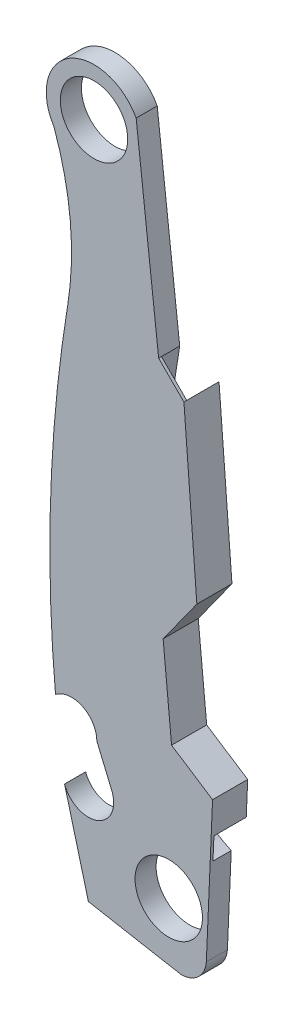
ISO-10303-21;
HEADER;
FILE_DESCRIPTION(('STEP AP214'),'2;1');
FILE_NAME('part.step','',(''),(''),'','','');
FILE_SCHEMA(('AUTOMOTIVE_DESIGN { 1 0 10303 214 1 1 1 1 }'));
ENDSEC;
DATA;
#1=APPLICATION_CONTEXT('core data for automotive mechanical design processes');
#2=APPLICATION_PROTOCOL_DEFINITION('international standard','automotive_design',2000,#1);
#3=PRODUCT_CONTEXT('',#1,'mechanical');
#4=PRODUCT('Part','Part','',(#3));
#5=PRODUCT_RELATED_PRODUCT_CATEGORY('part','',(#4));
#6=PRODUCT_DEFINITION_FORMATION('','',#4);
#7=PRODUCT_DEFINITION_CONTEXT('part definition',#1,'design');
#8=PRODUCT_DEFINITION('design','',#6,#7);
#9=PRODUCT_DEFINITION_SHAPE('','',#8);
#10=(LENGTH_UNIT() NAMED_UNIT(*) SI_UNIT(.MILLI.,.METRE.));
#11=(NAMED_UNIT(*) PLANE_ANGLE_UNIT() SI_UNIT($,.RADIAN.));
#12=(NAMED_UNIT(*) SI_UNIT($,.STERADIAN.) SOLID_ANGLE_UNIT());
#13=UNCERTAINTY_MEASURE_WITH_UNIT(LENGTH_MEASURE(1.E-05),#10,'distance_accuracy_value','');
#14=(GEOMETRIC_REPRESENTATION_CONTEXT(3) GLOBAL_UNCERTAINTY_ASSIGNED_CONTEXT((#13)) GLOBAL_UNIT_ASSIGNED_CONTEXT((#10,
#11,#12)) REPRESENTATION_CONTEXT('',''));
#15=CARTESIAN_POINT('',(0.,0.,0.));
#16=DIRECTION('',(0.,0.,1.));
#17=DIRECTION('',(1.,0.,0.));
#18=AXIS2_PLACEMENT_3D('',#15,#16,#17);
#19=CARTESIAN_POINT('',(-11.1999347164237,-31.2281622525082,0.));
#20=DIRECTION('',(0.,0.,-1.));
#21=DIRECTION('',(-1.,0.,0.));
#22=AXIS2_PLACEMENT_3D('',#19,#20,#21);
#23=PLANE('',#22);
#24=CARTESIAN_POINT('',(-19.0739347164237,29.4778377474918,0.));
#25=DIRECTION('',(0.,0.,1.));
#26=DIRECTION('',(1.,0.,0.));
#27=AXIS2_PLACEMENT_3D('',#24,#25,#26);
#28=CIRCLE('',#27,3.048);
#29=CARTESIAN_POINT('',(-16.0259347164237,29.4778377474918,0.));
#30=VERTEX_POINT('',#29);
#31=EDGE_CURVE('E335',#30,#30,#28,.T.);
#32=ORIENTED_EDGE('',*,*,#31,.T.);
#33=EDGE_LOOP('',(#32));
#34=FACE_BOUND('',#33,.T.);
#35=CARTESIAN_POINT('',(-12.3175347164237,-28.1039622525082,0.));
#36=DIRECTION('',(0.,0.,1.));
#37=DIRECTION('',(1.,0.,0.));
#38=AXIS2_PLACEMENT_3D('',#35,#36,#37);
#39=CIRCLE('',#38,3.04799999999983);
#40=CARTESIAN_POINT('',(-9.26953471642387,-28.1039622525082,0.));
#41=VERTEX_POINT('',#40);
#42=EDGE_CURVE('E331',#41,#41,#39,.T.);
#43=ORIENTED_EDGE('',*,*,#42,.T.);
#44=EDGE_LOOP('',(#43));
#45=FACE_BOUND('',#44,.T.);
#46=DIRECTION('',(-0.113546591160732,0.993532672656404,0.));
#47=VECTOR('',#46,1.);
#48=CARTESIAN_POINT('',(-13.2319347164237,13.7298377474918,0.));
#49=LINE('',#48,#47);
#50=CARTESIAN_POINT('',(-13.2319347164237,13.7298377474918,0.));
#51=VERTEX_POINT('',#50);
#52=CARTESIAN_POINT('',(-15.2639347164237,31.5098377474918,0.));
#53=VERTEX_POINT('',#52);
#54=EDGE_CURVE('E179',#51,#53,#49,.T.);
#55=ORIENTED_EDGE('',*,*,#54,.F.);
#56=CARTESIAN_POINT('',(319.000065283576,-40.8801622525082,0.));
#57=DIRECTION('',(0.,0.,1.));
#58=DIRECTION('',(1.,0.,0.));
#59=AXIS2_PLACEMENT_3D('',#56,#57,#58);
#60=CIRCLE('',#59,336.690293777531);
#61=CARTESIAN_POINT('',(-16.0259321563204,-7.44462781080484,0.));
#62=VERTEX_POINT('',#61);
#63=EDGE_CURVE('E254',#51,#62,#60,.T.);
#64=ORIENTED_EDGE('',*,*,#63,.T.);
#65=CARTESIAN_POINT('',(8.35806528357629,-7.45580149025422,0.));
#66=DIRECTION('',(0.,0.,1.));
#67=DIRECTION('',(1.,0.,0.));
#68=AXIS2_PLACEMENT_3D('',#65,#66,#67);
#69=CIRCLE('',#68,24.384);
#70=CARTESIAN_POINT('',(-11.6694612905259,-21.3654253285768,0.));
#71=VERTEX_POINT('',#70);
#72=EDGE_CURVE('E303',#62,#71,#69,.T.);
#73=ORIENTED_EDGE('',*,*,#72,.T.);
#74=CARTESIAN_POINT('',(-3.83393471642371,-13.0438014902542,0.));
#75=DIRECTION('',(0.,0.,1.));
#76=DIRECTION('',(-1.,0.,0.));
#77=AXIS2_PLACEMENT_3D('',#74,#75,#76);
#78=CIRCLE('',#77,11.43);
#79=CARTESIAN_POINT('',(-8.57425284994842,-23.4444881980143,0.));
#80=VERTEX_POINT('',#79);
#81=EDGE_CURVE('E279',#71,#80,#78,.T.);
#82=ORIENTED_EDGE('',*,*,#81,.T.);
#83=DIRECTION('',(0.0434062002984374,0.999057506741054,0.));
#84=VECTOR('',#83,1.);
#85=CARTESIAN_POINT('',(-8.35513471642371,-18.4011622525082,0.));
#86=LINE('',#85,#84);
#87=CARTESIAN_POINT('',(-8.91911187455432,-31.3819255901632,0.));
#88=VERTEX_POINT('',#87);
#89=EDGE_CURVE('E176',#88,#80,#86,.T.);
#90=ORIENTED_EDGE('',*,*,#89,.F.);
#91=CARTESIAN_POINT('',(-11.1999347164237,-31.2281622525082,0.));
#92=DIRECTION('',(0.,0.,1.));
#93=DIRECTION('',(-1.,0.,0.));
#94=AXIS2_PLACEMENT_3D('',#91,#92,#93);
#95=CIRCLE('',#94,2.286);
#96=CARTESIAN_POINT('',(-11.1999347164234,-33.5141622525081,0.));
#97=VERTEX_POINT('',#96);
#98=EDGE_CURVE('E103',#97,#88,#95,.T.);
#99=ORIENTED_EDGE('',*,*,#98,.F.);
#100=CARTESIAN_POINT('',(206.203522791087,1186.0173540388,0.));
#101=DIRECTION('',(0.,0.,1.));
#102=DIRECTION('',(1.,0.,0.));
#103=AXIS2_PLACEMENT_3D('',#100,#101,#102);
#104=CIRCLE('',#103,1238.758);
#105=CARTESIAN_POINT('',(-19.5819347164237,-31.9901622525082,0.));
#106=VERTEX_POINT('',#105);
#107=EDGE_CURVE('E97',#106,#97,#104,.T.);
#108=ORIENTED_EDGE('',*,*,#107,.F.);
#109=DIRECTION('',(0.256307297315027,-0.966595349328283,0.));
#110=VECTOR('',#109,1.);
#111=CARTESIAN_POINT('',(-21.7371961854803,-23.8621622525082,0.));
#112=LINE('',#111,#110);
#113=CARTESIAN_POINT('',(-21.7371961854803,-23.8621622525082,0.));
#114=VERTEX_POINT('',#113);
#115=EDGE_CURVE('E166',#114,#106,#112,.T.);
#116=ORIENTED_EDGE('',*,*,#115,.F.);
#117=CARTESIAN_POINT('',(-19.5819347164237,-23.1001622525082,0.));
#118=DIRECTION('',(0.,0.,-1.));
#119=DIRECTION('',(-1.,0.,0.));
#120=AXIS2_PLACEMENT_3D('',#117,#118,#119);
#121=CIRCLE('',#120,2.286);
#122=CARTESIAN_POINT('',(-17.5341212483559,-22.0841622525082,0.));
#123=VERTEX_POINT('',#122);
#124=EDGE_CURVE('E192',#123,#114,#121,.T.);
#125=ORIENTED_EDGE('',*,*,#124,.F.);
#126=DIRECTION('',(0.388684715327392,-0.92137082223764,0.));
#127=VECTOR('',#126,1.);
#128=CARTESIAN_POINT('',(-18.8199347164237,-19.0361622525082,0.));
#129=LINE('',#128,#127);
#130=CARTESIAN_POINT('',(-18.8199347164237,-19.0361622525082,0.));
#131=VERTEX_POINT('',#130);
#132=EDGE_CURVE('E190',#131,#123,#129,.T.);
#133=ORIENTED_EDGE('',*,*,#132,.F.);
#134=CARTESIAN_POINT('',(-21.1059347164237,-19.0361622525082,0.));
#135=DIRECTION('',(0.,0.,-1.));
#136=DIRECTION('',(-1.,0.,0.));
#137=AXIS2_PLACEMENT_3D('',#134,#135,#136);
#138=CIRCLE('',#137,2.28600000000001);
#139=CARTESIAN_POINT('',(-22.5553916541724,-17.2684319038372,0.));
#140=VERTEX_POINT('',#139);
#141=EDGE_CURVE('E188',#140,#131,#138,.T.);
#142=ORIENTED_EDGE('',*,*,#141,.F.);
#143=CARTESIAN_POINT('',(99.7980652835763,-6.08216225250816,0.));
#144=DIRECTION('',(0.,0.,1.));
#145=DIRECTION('',(1.,0.,0.));
#146=AXIS2_PLACEMENT_3D('',#143,#144,#145);
#147=CIRCLE('',#146,122.863749956323);
#148=CARTESIAN_POINT('',(-21.4554647145037,13.7441464390884,0.));
#149=VERTEX_POINT('',#148);
#150=EDGE_CURVE('E186',#149,#140,#147,.T.);
#151=ORIENTED_EDGE('',*,*,#150,.F.);
#152=CARTESIAN_POINT('',(-47.7759347164237,18.0478377474918,0.));
#153=DIRECTION('',(0.,0.,-1.));
#154=DIRECTION('',(1.,0.,0.));
#155=AXIS2_PLACEMENT_3D('',#152,#153,#154);
#156=CIRCLE('',#155,26.67);
#157=CARTESIAN_POINT('',(-22.7027062252491,27.137508425209,0.));
#158=VERTEX_POINT('',#157);
#159=EDGE_CURVE('E184',#158,#149,#156,.T.);
#160=ORIENTED_EDGE('',*,*,#159,.F.);
#161=CARTESIAN_POINT('',(-19.0739347164237,29.4778377474918,0.));
#162=DIRECTION('',(0.,0.,1.));
#163=DIRECTION('',(1.,0.,0.));
#164=AXIS2_PLACEMENT_3D('',#161,#162,#163);
#165=CIRCLE('',#164,4.318);
#166=EDGE_CURVE('E182',#53,#158,#165,.T.);
#167=ORIENTED_EDGE('',*,*,#166,.F.);
#168=EDGE_LOOP('',(#55,#64,#73,#82,#90,#99,#108,#116,#125,#133,#142,#151,#160,#167));
#169=FACE_BOUND('',#168,.T.);
#170=ADVANCED_FACE('F41',(#34,#45,#169),#23,.T.);
#171=CARTESIAN_POINT('',(-8.35513471642371,-18.4011622525082,1.905));
#172=DIRECTION('',(-0.999057506741054,0.0434062002984374,0.));
#173=DIRECTION('',(-0.0434062002984374,-0.999057506741054,0.));
#174=AXIS2_PLACEMENT_3D('',#171,#172,#173);
#175=PLANE('',#174);
#176=DIRECTION('',(0.,0.,-1.));
#177=VECTOR('',#176,1.);
#178=CARTESIAN_POINT('',(-8.48654666788623,-21.4258014902542,1.651));
#179=LINE('',#178,#177);
#180=CARTESIAN_POINT('',(-8.48654666788623,-21.4258014902542,1.651));
#181=VERTEX_POINT('',#180);
#182=CARTESIAN_POINT('',(-8.48654666788623,-21.4258014902542,-1.27));
#183=VERTEX_POINT('',#182);
#184=EDGE_CURVE('E300',#181,#183,#179,.T.);
#185=ORIENTED_EDGE('',*,*,#184,.T.);
#186=DIRECTION('',(-0.0434062002984379,-0.999057506741054,0.));
#187=VECTOR('',#186,1.);
#188=CARTESIAN_POINT('',(-8.35513471642371,-18.4011622525082,-1.27));
#189=LINE('',#188,#187);
#190=CARTESIAN_POINT('',(-8.35513471642371,-18.4011622525082,-1.27));
#191=VERTEX_POINT('',#190);
#192=EDGE_CURVE('E259',#191,#183,#189,.T.);
#193=ORIENTED_EDGE('',*,*,#192,.F.);
#194=DIRECTION('',(0.,0.,-1.));
#195=VECTOR('',#194,1.);
#196=CARTESIAN_POINT('',(-8.35513471642371,-18.4011622525082,1.905));
#197=LINE('',#196,#195);
#198=CARTESIAN_POINT('',(-8.35513471642371,-18.4011622525082,1.905));
#199=VERTEX_POINT('',#198);
#200=EDGE_CURVE('E11',#199,#191,#197,.T.);
#201=ORIENTED_EDGE('',*,*,#200,.F.);
#202=DIRECTION('',(0.0434062002984374,0.999057506741054,0.));
#203=VECTOR('',#202,1.);
#204=CARTESIAN_POINT('',(-8.35513471642371,-18.4011622525082,1.905));
#205=LINE('',#204,#203);
#206=CARTESIAN_POINT('',(-8.91911187455432,-31.3819255901632,1.905));
#207=VERTEX_POINT('',#206);
#208=EDGE_CURVE('E197',#207,#199,#205,.T.);
#209=ORIENTED_EDGE('',*,*,#208,.F.);
#210=DIRECTION('',(0.,0.,-1.));
#211=VECTOR('',#210,1.);
#212=CARTESIAN_POINT('',(-8.91911187455432,-31.3819255901632,1.905));
#213=LINE('',#212,#211);
#214=EDGE_CURVE('E172',#207,#88,#213,.T.);
#215=ORIENTED_EDGE('',*,*,#214,.T.);
#216=ORIENTED_EDGE('',*,*,#89,.T.);
#217=DIRECTION('',(0.,0.,-1.));
#218=VECTOR('',#217,1.);
#219=CARTESIAN_POINT('',(-8.57425284994842,-23.4444881980143,1.651));
#220=LINE('',#219,#218);
#221=CARTESIAN_POINT('',(-8.57425284994842,-23.4444881980143,1.651));
#222=VERTEX_POINT('',#221);
#223=EDGE_CURVE('E310',#222,#80,#220,.T.);
#224=ORIENTED_EDGE('',*,*,#223,.F.);
#225=DIRECTION('',(0.0434062002984384,0.999057506741054,0.));
#226=VECTOR('',#225,1.);
#227=CARTESIAN_POINT('',(-8.48654666788623,-21.4258014902542,1.651));
#228=LINE('',#227,#226);
#229=EDGE_CURVE('E297',#222,#181,#228,.T.);
#230=ORIENTED_EDGE('',*,*,#229,.T.);
#231=EDGE_LOOP('',(#185,#193,#201,#209,#215,#216,#224,#230));
#232=FACE_BOUND('',#231,.T.);
#233=ADVANCED_FACE('F43',(#232),#175,.F.);
#234=CARTESIAN_POINT('',(-11.1999347164237,-31.2281622525082,1.905));
#235=DIRECTION('',(0.,0.,-1.));
#236=DIRECTION('',(-1.,0.,0.));
#237=AXIS2_PLACEMENT_3D('',#234,#235,#236);
#238=PLANE('',#237);
#239=ORIENTED_EDGE('',*,*,#208,.T.);
#240=DIRECTION('',(-0.838181190269875,0.545391870381083,0.));
#241=VECTOR('',#240,1.);
#242=CARTESIAN_POINT('',(-12.0635347164237,-15.9881622525082,1.905));
#243=LINE('',#242,#241);
#244=CARTESIAN_POINT('',(-12.0635347164237,-15.9881622525082,1.905));
#245=VERTEX_POINT('',#244);
#246=EDGE_CURVE('E111',#199,#245,#243,.T.);
#247=ORIENTED_EDGE('',*,*,#246,.T.);
#248=DIRECTION('',(-0.0954094042242544,0.995438117406387,0.));
#249=VECTOR('',#248,1.);
#250=CARTESIAN_POINT('',(-12.8255347164237,-8.03796225250817,1.905));
#251=LINE('',#250,#249);
#252=CARTESIAN_POINT('',(-12.8255347164237,-8.03796225250817,1.905));
#253=VERTEX_POINT('',#252);
#254=EDGE_CURVE('E240',#245,#253,#251,.T.);
#255=ORIENTED_EDGE('',*,*,#254,.T.);
#256=DIRECTION('',(0.583535844379834,0.812087383428602,0.));
#257=VECTOR('',#256,1.);
#258=CARTESIAN_POINT('',(-9.77753471642371,-3.79616225250817,1.905));
#259=LINE('',#258,#257);
#260=CARTESIAN_POINT('',(-9.77753471642371,-3.79616225250817,1.905));
#261=VERTEX_POINT('',#260);
#262=EDGE_CURVE('E345',#253,#261,#259,.T.);
#263=ORIENTED_EDGE('',*,*,#262,.T.);
#264=DIRECTION('',(-0.0764423402744023,0.997074003579159,0.));
#265=VECTOR('',#264,1.);
#266=CARTESIAN_POINT('',(-10.9459347164237,11.4438377474918,1.905));
#267=LINE('',#266,#265);
#268=CARTESIAN_POINT('',(-10.9459347164237,11.4438377474918,1.905));
#269=VERTEX_POINT('',#268);
#270=EDGE_CURVE('E347',#261,#269,#267,.T.);
#271=ORIENTED_EDGE('',*,*,#270,.T.);
#272=DIRECTION('',(-0.707106781186548,0.707106781186547,0.));
#273=VECTOR('',#272,1.);
#274=CARTESIAN_POINT('',(-13.2319347164237,13.7298377474918,1.905));
#275=LINE('',#274,#273);
#276=CARTESIAN_POINT('',(-13.2319347164237,13.7298377474918,1.905));
#277=VERTEX_POINT('',#276);
#278=EDGE_CURVE('E349',#269,#277,#275,.T.);
#279=ORIENTED_EDGE('',*,*,#278,.T.);
#280=DIRECTION('',(-0.113546591160732,0.993532672656404,0.));
#281=VECTOR('',#280,1.);
#282=CARTESIAN_POINT('',(-13.2319347164237,13.7298377474918,1.905));
#283=LINE('',#282,#281);
#284=CARTESIAN_POINT('',(-15.2639347164237,31.5098377474918,1.905));
#285=VERTEX_POINT('',#284);
#286=EDGE_CURVE('E351',#277,#285,#283,.T.);
#287=ORIENTED_EDGE('',*,*,#286,.T.);
#288=CARTESIAN_POINT('',(-19.0739347164237,29.4778377474918,1.905));
#289=DIRECTION('',(0.,0.,1.));
#290=DIRECTION('',(1.,0.,0.));
#291=AXIS2_PLACEMENT_3D('',#288,#289,#290);
#292=CIRCLE('',#291,4.318);
#293=CARTESIAN_POINT('',(-22.7027062252491,27.137508425209,1.905));
#294=VERTEX_POINT('',#293);
#295=EDGE_CURVE('E353',#285,#294,#292,.T.);
#296=ORIENTED_EDGE('',*,*,#295,.T.);
#297=CARTESIAN_POINT('',(-47.7759347164237,18.0478377474918,1.905));
#298=DIRECTION('',(0.,0.,-1.));
#299=DIRECTION('',(1.,0.,0.));
#300=AXIS2_PLACEMENT_3D('',#297,#298,#299);
#301=CIRCLE('',#300,26.67);
#302=CARTESIAN_POINT('',(-21.4554647145037,13.7441464390884,1.905));
#303=VERTEX_POINT('',#302);
#304=EDGE_CURVE('E355',#294,#303,#301,.T.);
#305=ORIENTED_EDGE('',*,*,#304,.T.);
#306=CARTESIAN_POINT('',(99.7980652835763,-6.08216225250816,1.905));
#307=DIRECTION('',(0.,0.,1.));
#308=DIRECTION('',(1.,0.,0.));
#309=AXIS2_PLACEMENT_3D('',#306,#307,#308);
#310=CIRCLE('',#309,122.863749956323);
#311=CARTESIAN_POINT('',(-22.5553916541724,-17.2684319038372,1.905));
#312=VERTEX_POINT('',#311);
#313=EDGE_CURVE('E357',#303,#312,#310,.T.);
#314=ORIENTED_EDGE('',*,*,#313,.T.);
#315=CARTESIAN_POINT('',(-21.1059347164237,-19.0361622525082,1.905));
#316=DIRECTION('',(0.,0.,-1.));
#317=DIRECTION('',(-1.,0.,0.));
#318=AXIS2_PLACEMENT_3D('',#315,#316,#317);
#319=CIRCLE('',#318,2.28600000000001);
#320=CARTESIAN_POINT('',(-18.8199347164237,-19.0361622525082,1.905));
#321=VERTEX_POINT('',#320);
#322=EDGE_CURVE('E359',#312,#321,#319,.T.);
#323=ORIENTED_EDGE('',*,*,#322,.T.);
#324=DIRECTION('',(0.388684715327392,-0.92137082223764,0.));
#325=VECTOR('',#324,1.);
#326=CARTESIAN_POINT('',(-18.8199347164237,-19.0361622525082,1.905));
#327=LINE('',#326,#325);
#328=CARTESIAN_POINT('',(-17.5341212483559,-22.0841622525082,1.905));
#329=VERTEX_POINT('',#328);
#330=EDGE_CURVE('E361',#321,#329,#327,.T.);
#331=ORIENTED_EDGE('',*,*,#330,.T.);
#332=CARTESIAN_POINT('',(-19.5819347164237,-23.1001622525082,1.905));
#333=DIRECTION('',(0.,0.,-1.));
#334=DIRECTION('',(-1.,0.,0.));
#335=AXIS2_PLACEMENT_3D('',#332,#333,#334);
#336=CIRCLE('',#335,2.286);
#337=CARTESIAN_POINT('',(-21.7371961854803,-23.8621622525082,1.905));
#338=VERTEX_POINT('',#337);
#339=EDGE_CURVE('E158',#329,#338,#336,.T.);
#340=ORIENTED_EDGE('',*,*,#339,.T.);
#341=DIRECTION('',(0.256307297315027,-0.966595349328283,0.));
#342=VECTOR('',#341,1.);
#343=CARTESIAN_POINT('',(-21.7371961854803,-23.8621622525082,1.905));
#344=LINE('',#343,#342);
#345=CARTESIAN_POINT('',(-19.5819347164237,-31.9901622525082,1.905));
#346=VERTEX_POINT('',#345);
#347=EDGE_CURVE('E151',#338,#346,#344,.T.);
#348=ORIENTED_EDGE('',*,*,#347,.T.);
#349=CARTESIAN_POINT('',(206.203522791087,1186.0173540388,1.905));
#350=DIRECTION('',(0.,0.,1.));
#351=DIRECTION('',(1.,0.,0.));
#352=AXIS2_PLACEMENT_3D('',#349,#350,#351);
#353=CIRCLE('',#352,1238.758);
#354=CARTESIAN_POINT('',(-11.1999347164234,-33.5141622525081,1.905));
#355=VERTEX_POINT('',#354);
#356=EDGE_CURVE('E156',#346,#355,#353,.T.);
#357=ORIENTED_EDGE('',*,*,#356,.T.);
#358=CARTESIAN_POINT('',(-11.1999347164237,-31.2281622525082,1.905));
#359=DIRECTION('',(0.,0.,1.));
#360=DIRECTION('',(-1.,0.,0.));
#361=AXIS2_PLACEMENT_3D('',#358,#359,#360);
#362=CIRCLE('',#361,2.286);
#363=EDGE_CURVE('E58',#355,#207,#362,.T.);
#364=ORIENTED_EDGE('',*,*,#363,.T.);
#365=EDGE_LOOP('',(#239,#247,#255,#263,#271,#279,#287,#296,#305,#314,#323,#331,#340,#348,#357,#364));
#366=FACE_BOUND('',#365,.T.);
#367=CARTESIAN_POINT('',(-19.0739347164237,29.4778377474918,1.905));
#368=DIRECTION('',(0.,0.,1.));
#369=DIRECTION('',(1.,0.,0.));
#370=AXIS2_PLACEMENT_3D('',#367,#368,#369);
#371=CIRCLE('',#370,3.048);
#372=CARTESIAN_POINT('',(-16.0259347164237,29.4778377474918,1.905));
#373=VERTEX_POINT('',#372);
#374=EDGE_CURVE('E180',#373,#373,#371,.T.);
#375=ORIENTED_EDGE('',*,*,#374,.F.);
#376=EDGE_LOOP('',(#375));
#377=FACE_BOUND('',#376,.T.);
#378=CARTESIAN_POINT('',(-12.3175347164237,-28.1039622525082,1.905));
#379=DIRECTION('',(0.,0.,1.));
#380=DIRECTION('',(1.,0.,0.));
#381=AXIS2_PLACEMENT_3D('',#378,#379,#380);
#382=CIRCLE('',#381,3.04799999999983);
#383=CARTESIAN_POINT('',(-9.26953471642387,-28.1039622525082,1.905));
#384=VERTEX_POINT('',#383);
#385=EDGE_CURVE('E332',#384,#384,#382,.T.);
#386=ORIENTED_EDGE('',*,*,#385,.F.);
#387=EDGE_LOOP('',(#386));
#388=FACE_BOUND('',#387,.T.);
#389=ADVANCED_FACE('F153',(#366,#377,#388),#238,.F.);
#390=CARTESIAN_POINT('',(-12.0635347164237,-15.9881622525082,1.905));
#391=DIRECTION('',(-0.545391870381083,-0.838181190269875,0.));
#392=DIRECTION('',(0.838181190269875,-0.545391870381083,0.));
#393=AXIS2_PLACEMENT_3D('',#390,#391,#392);
#394=PLANE('',#393);
#395=ORIENTED_EDGE('',*,*,#200,.T.);
#396=DIRECTION('',(0.838181190269875,-0.545391870381083,0.));
#397=VECTOR('',#396,1.);
#398=CARTESIAN_POINT('',(-12.0635347164237,-15.9881622525082,-1.27));
#399=LINE('',#398,#397);
#400=CARTESIAN_POINT('',(-12.0635347164237,-15.9881622525082,-1.27));
#401=VERTEX_POINT('',#400);
#402=EDGE_CURVE('E250',#401,#191,#399,.T.);
#403=ORIENTED_EDGE('',*,*,#402,.F.);
#404=DIRECTION('',(0.,0.,-1.));
#405=VECTOR('',#404,1.);
#406=CARTESIAN_POINT('',(-12.0635347164237,-15.9881622525082,1.905));
#407=LINE('',#406,#405);
#408=EDGE_CURVE('E50',#245,#401,#407,.T.);
#409=ORIENTED_EDGE('',*,*,#408,.F.);
#410=ORIENTED_EDGE('',*,*,#246,.F.);
#411=EDGE_LOOP('',(#395,#403,#409,#410));
#412=FACE_BOUND('',#411,.T.);
#413=ADVANCED_FACE('F256',(#412),#394,.F.);
#414=CARTESIAN_POINT('',(-12.8255347164237,-8.03796225250817,1.905));
#415=DIRECTION('',(-0.995438117406387,-0.0954094042242544,0.));
#416=DIRECTION('',(0.0954094042242545,-0.995438117406388,0.));
#417=AXIS2_PLACEMENT_3D('',#414,#415,#416);
#418=PLANE('',#417);
#419=ORIENTED_EDGE('',*,*,#408,.T.);
#420=DIRECTION('',(0.0954094042242544,-0.995438117406387,0.));
#421=VECTOR('',#420,1.);
#422=CARTESIAN_POINT('',(-12.8255347164237,-8.03796225250817,-1.27));
#423=LINE('',#422,#421);
#424=CARTESIAN_POINT('',(-12.8255347164237,-8.03796225250817,-1.27));
#425=VERTEX_POINT('',#424);
#426=EDGE_CURVE('E239',#425,#401,#423,.T.);
#427=ORIENTED_EDGE('',*,*,#426,.F.);
#428=DIRECTION('',(0.,0.,-1.));
#429=VECTOR('',#428,1.);
#430=CARTESIAN_POINT('',(-12.8255347164237,-8.03796225250817,1.905));
#431=LINE('',#430,#429);
#432=EDGE_CURVE('E228',#253,#425,#431,.T.);
#433=ORIENTED_EDGE('',*,*,#432,.F.);
#434=ORIENTED_EDGE('',*,*,#254,.F.);
#435=EDGE_LOOP('',(#419,#427,#433,#434));
#436=FACE_BOUND('',#435,.T.);
#437=ADVANCED_FACE('F236',(#436),#418,.F.);
#438=CARTESIAN_POINT('',(-9.77753471642371,-3.79616225250817,1.905));
#439=DIRECTION('',(-0.812087383428603,0.583535844379834,0.));
#440=DIRECTION('',(-0.583535844379834,-0.812087383428603,0.));
#441=AXIS2_PLACEMENT_3D('',#438,#439,#440);
#442=PLANE('',#441);
#443=ORIENTED_EDGE('',*,*,#432,.T.);
#444=DIRECTION('',(-0.583535844379834,-0.812087383428602,0.));
#445=VECTOR('',#444,1.);
#446=CARTESIAN_POINT('',(-9.77753471642371,-3.79616225250817,-1.27));
#447=LINE('',#446,#445);
#448=CARTESIAN_POINT('',(-9.77753471642371,-3.79616225250817,-1.27));
#449=VERTEX_POINT('',#448);
#450=EDGE_CURVE('E253',#449,#425,#447,.T.);
#451=ORIENTED_EDGE('',*,*,#450,.F.);
#452=DIRECTION('',(0.,0.,-1.));
#453=VECTOR('',#452,1.);
#454=CARTESIAN_POINT('',(-9.77753471642371,-3.79616225250817,1.905));
#455=LINE('',#454,#453);
#456=EDGE_CURVE('E225',#261,#449,#455,.T.);
#457=ORIENTED_EDGE('',*,*,#456,.F.);
#458=ORIENTED_EDGE('',*,*,#262,.F.);
#459=EDGE_LOOP('',(#443,#451,#457,#458));
#460=FACE_BOUND('',#459,.T.);
#461=ADVANCED_FACE('F445',(#460),#442,.F.);
#462=CARTESIAN_POINT('',(-10.9459347164237,11.4438377474918,1.905));
#463=DIRECTION('',(-0.997074003579159,-0.0764423402744023,0.));
#464=DIRECTION('',(0.0764423402744023,-0.997074003579159,0.));
#465=AXIS2_PLACEMENT_3D('',#462,#463,#464);
#466=PLANE('',#465);
#467=ORIENTED_EDGE('',*,*,#456,.T.);
#468=DIRECTION('',(0.076442340274401,-0.997074003579159,0.));
#469=VECTOR('',#468,1.);
#470=CARTESIAN_POINT('',(-10.9459347164237,11.4438377474918,-1.27));
#471=LINE('',#470,#469);
#472=CARTESIAN_POINT('',(-10.9459347164237,11.4438377474918,-1.27));
#473=VERTEX_POINT('',#472);
#474=EDGE_CURVE('E272',#473,#449,#471,.T.);
#475=ORIENTED_EDGE('',*,*,#474,.F.);
#476=DIRECTION('',(0.,0.,-1.));
#477=VECTOR('',#476,1.);
#478=CARTESIAN_POINT('',(-10.9459347164237,11.4438377474918,1.651));
#479=LINE('',#478,#477);
#480=CARTESIAN_POINT('',(-10.9459347164237,11.4438377474918,1.651));
#481=VERTEX_POINT('',#480);
#482=EDGE_CURVE('E322',#481,#473,#479,.T.);
#483=ORIENTED_EDGE('',*,*,#482,.F.);
#484=DIRECTION('',(0.,0.,-1.));
#485=VECTOR('',#484,1.);
#486=CARTESIAN_POINT('',(-10.9459347164237,11.4438377474918,1.905));
#487=LINE('',#486,#485);
#488=EDGE_CURVE('E222',#269,#481,#487,.T.);
#489=ORIENTED_EDGE('',*,*,#488,.F.);
#490=ORIENTED_EDGE('',*,*,#270,.F.);
#491=EDGE_LOOP('',(#467,#475,#483,#489,#490));
#492=FACE_BOUND('',#491,.T.);
#493=ADVANCED_FACE('F434',(#492),#466,.F.);
#494=CARTESIAN_POINT('',(-13.2319347164237,13.7298377474918,1.905));
#495=DIRECTION('',(-0.707106781186547,-0.707106781186548,0.));
#496=DIRECTION('',(0.707106781186548,-0.707106781186547,0.));
#497=AXIS2_PLACEMENT_3D('',#494,#495,#496);
#498=PLANE('',#497);
#499=ORIENTED_EDGE('',*,*,#488,.T.);
#500=DIRECTION('',(-0.707106781186547,0.707106781186548,0.));
#501=VECTOR('',#500,1.);
#502=CARTESIAN_POINT('',(-10.9459347164237,11.4438377474918,1.651));
#503=LINE('',#502,#501);
#504=CARTESIAN_POINT('',(-13.2319347164237,13.7298377474918,1.651));
#505=VERTEX_POINT('',#504);
#506=EDGE_CURVE('E285',#481,#505,#503,.T.);
#507=ORIENTED_EDGE('',*,*,#506,.T.);
#508=DIRECTION('',(0.,0.,-1.));
#509=VECTOR('',#508,1.);
#510=CARTESIAN_POINT('',(-13.2319347164237,13.7298377474918,1.905));
#511=LINE('',#510,#509);
#512=EDGE_CURVE('E219',#277,#505,#511,.T.);
#513=ORIENTED_EDGE('',*,*,#512,.F.);
#514=ORIENTED_EDGE('',*,*,#278,.F.);
#515=EDGE_LOOP('',(#499,#507,#513,#514));
#516=FACE_BOUND('',#515,.T.);
#517=ADVANCED_FACE('F438',(#516),#498,.F.);
#518=CARTESIAN_POINT('',(-13.2319347164237,13.7298377474918,1.905));
#519=DIRECTION('',(-0.993532672656404,-0.113546591160732,0.));
#520=DIRECTION('',(0.113546591160732,-0.993532672656404,0.));
#521=AXIS2_PLACEMENT_3D('',#518,#519,#520);
#522=PLANE('',#521);
#523=ORIENTED_EDGE('',*,*,#54,.T.);
#524=DIRECTION('',(0.,0.,-1.));
#525=VECTOR('',#524,1.);
#526=CARTESIAN_POINT('',(-15.2639347164237,31.5098377474918,1.905));
#527=LINE('',#526,#525);
#528=EDGE_CURVE('E216',#285,#53,#527,.T.);
#529=ORIENTED_EDGE('',*,*,#528,.F.);
#530=ORIENTED_EDGE('',*,*,#286,.F.);
#531=ORIENTED_EDGE('',*,*,#512,.T.);
#532=DIRECTION('',(0.,0.,-1.));
#533=VECTOR('',#532,1.);
#534=CARTESIAN_POINT('',(-13.2319347164237,13.7298377474918,1.651));
#535=LINE('',#534,#533);
#536=EDGE_CURVE('E319',#505,#51,#535,.T.);
#537=ORIENTED_EDGE('',*,*,#536,.T.);
#538=EDGE_LOOP('',(#523,#529,#530,#531,#537));
#539=FACE_BOUND('',#538,.T.);
#540=ADVANCED_FACE('F491',(#539),#522,.F.);
#541=CARTESIAN_POINT('',(-19.0739347164237,29.4778377474918,1.905));
#542=DIRECTION('',(0.,0.,-1.));
#543=DIRECTION('',(-1.,0.,0.));
#544=AXIS2_PLACEMENT_3D('',#541,#542,#543);
#545=CYLINDRICAL_SURFACE('',#544,4.318);
#546=ORIENTED_EDGE('',*,*,#166,.T.);
#547=DIRECTION('',(0.,0.,-1.));
#548=VECTOR('',#547,1.);
#549=CARTESIAN_POINT('',(-22.7027062252491,27.137508425209,1.905));
#550=LINE('',#549,#548);
#551=EDGE_CURVE('E213',#294,#158,#550,.T.);
#552=ORIENTED_EDGE('',*,*,#551,.F.);
#553=ORIENTED_EDGE('',*,*,#295,.F.);
#554=ORIENTED_EDGE('',*,*,#528,.T.);
#555=EDGE_LOOP('',(#546,#552,#553,#554));
#556=FACE_BOUND('',#555,.T.);
#557=ADVANCED_FACE('F487',(#556),#545,.T.);
#558=CARTESIAN_POINT('',(-47.7759347164237,18.0478377474918,1.905));
#559=DIRECTION('',(0.,0.,-1.));
#560=DIRECTION('',(-1.,0.,0.));
#561=AXIS2_PLACEMENT_3D('',#558,#559,#560);
#562=CYLINDRICAL_SURFACE('',#561,26.67);
#563=ORIENTED_EDGE('',*,*,#159,.T.);
#564=DIRECTION('',(0.,0.,-1.));
#565=VECTOR('',#564,1.);
#566=CARTESIAN_POINT('',(-21.4554647145037,13.7441464390884,1.905));
#567=LINE('',#566,#565);
#568=EDGE_CURVE('E210',#303,#149,#567,.T.);
#569=ORIENTED_EDGE('',*,*,#568,.F.);
#570=ORIENTED_EDGE('',*,*,#304,.F.);
#571=ORIENTED_EDGE('',*,*,#551,.T.);
#572=EDGE_LOOP('',(#563,#569,#570,#571));
#573=FACE_BOUND('',#572,.T.);
#574=ADVANCED_FACE('F483',(#573),#562,.F.);
#575=CARTESIAN_POINT('',(99.7980652835763,-6.08216225250816,1.905));
#576=DIRECTION('',(0.,0.,-1.));
#577=DIRECTION('',(-1.,0.,0.));
#578=AXIS2_PLACEMENT_3D('',#575,#576,#577);
#579=CYLINDRICAL_SURFACE('',#578,122.863749956323);
#580=ORIENTED_EDGE('',*,*,#150,.T.);
#581=DIRECTION('',(0.,0.,-1.));
#582=VECTOR('',#581,1.);
#583=CARTESIAN_POINT('',(-22.5553916541724,-17.2684319038372,1.905));
#584=LINE('',#583,#582);
#585=EDGE_CURVE('E207',#312,#140,#584,.T.);
#586=ORIENTED_EDGE('',*,*,#585,.F.);
#587=ORIENTED_EDGE('',*,*,#313,.F.);
#588=ORIENTED_EDGE('',*,*,#568,.T.);
#589=EDGE_LOOP('',(#580,#586,#587,#588));
#590=FACE_BOUND('',#589,.T.);
#591=ADVANCED_FACE('F479',(#590),#579,.T.);
#592=CARTESIAN_POINT('',(-21.1059347164237,-19.0361622525082,1.905));
#593=DIRECTION('',(0.,0.,-1.));
#594=DIRECTION('',(-1.,0.,0.));
#595=AXIS2_PLACEMENT_3D('',#592,#593,#594);
#596=CYLINDRICAL_SURFACE('',#595,2.28600000000001);
#597=ORIENTED_EDGE('',*,*,#141,.T.);
#598=DIRECTION('',(0.,0.,-1.));
#599=VECTOR('',#598,1.);
#600=CARTESIAN_POINT('',(-18.8199347164237,-19.0361622525082,1.905));
#601=LINE('',#600,#599);
#602=EDGE_CURVE('E204',#321,#131,#601,.T.);
#603=ORIENTED_EDGE('',*,*,#602,.F.);
#604=ORIENTED_EDGE('',*,*,#322,.F.);
#605=ORIENTED_EDGE('',*,*,#585,.T.);
#606=EDGE_LOOP('',(#597,#603,#604,#605));
#607=FACE_BOUND('',#606,.T.);
#608=ADVANCED_FACE('F476',(#607),#596,.F.);
#609=CARTESIAN_POINT('',(-18.8199347164237,-19.0361622525082,1.905));
#610=DIRECTION('',(0.92137082223764,0.388684715327392,0.));
#611=DIRECTION('',(-0.388684715327392,0.92137082223764,0.));
#612=AXIS2_PLACEMENT_3D('',#609,#610,#611);
#613=PLANE('',#612);
#614=ORIENTED_EDGE('',*,*,#132,.T.);
#615=DIRECTION('',(0.,0.,-1.));
#616=VECTOR('',#615,1.);
#617=CARTESIAN_POINT('',(-17.5341212483559,-22.0841622525082,1.905));
#618=LINE('',#617,#616);
#619=EDGE_CURVE('E201',#329,#123,#618,.T.);
#620=ORIENTED_EDGE('',*,*,#619,.F.);
#621=ORIENTED_EDGE('',*,*,#330,.F.);
#622=ORIENTED_EDGE('',*,*,#602,.T.);
#623=EDGE_LOOP('',(#614,#620,#621,#622));
#624=FACE_BOUND('',#623,.T.);
#625=ADVANCED_FACE('F367',(#624),#613,.F.);
#626=CARTESIAN_POINT('',(-19.5819347164237,-23.1001622525082,1.905));
#627=DIRECTION('',(0.,0.,-1.));
#628=DIRECTION('',(-1.,0.,0.));
#629=AXIS2_PLACEMENT_3D('',#626,#627,#628);
#630=CYLINDRICAL_SURFACE('',#629,2.286);
#631=ORIENTED_EDGE('',*,*,#124,.T.);
#632=DIRECTION('',(0.,0.,-1.));
#633=VECTOR('',#632,1.);
#634=CARTESIAN_POINT('',(-21.7371961854803,-23.8621622525082,1.905));
#635=LINE('',#634,#633);
#636=EDGE_CURVE('E167',#338,#114,#635,.T.);
#637=ORIENTED_EDGE('',*,*,#636,.F.);
#638=ORIENTED_EDGE('',*,*,#339,.F.);
#639=ORIENTED_EDGE('',*,*,#619,.T.);
#640=EDGE_LOOP('',(#631,#637,#638,#639));
#641=FACE_BOUND('',#640,.T.);
#642=ADVANCED_FACE('F371',(#641),#630,.F.);
#643=CARTESIAN_POINT('',(-21.7371961854803,-23.8621622525082,1.905));
#644=DIRECTION('',(0.966595349328283,0.256307297315027,0.));
#645=DIRECTION('',(-0.256307297315027,0.966595349328283,0.));
#646=AXIS2_PLACEMENT_3D('',#643,#644,#645);
#647=PLANE('',#646);
#648=ORIENTED_EDGE('',*,*,#115,.T.);
#649=DIRECTION('',(0.,0.,-1.));
#650=VECTOR('',#649,1.);
#651=CARTESIAN_POINT('',(-19.5819347164237,-31.9901622525082,1.905));
#652=LINE('',#651,#650);
#653=EDGE_CURVE('E163',#346,#106,#652,.T.);
#654=ORIENTED_EDGE('',*,*,#653,.F.);
#655=ORIENTED_EDGE('',*,*,#347,.F.);
#656=ORIENTED_EDGE('',*,*,#636,.T.);
#657=EDGE_LOOP('',(#648,#654,#655,#656));
#658=FACE_BOUND('',#657,.T.);
#659=ADVANCED_FACE('F164',(#658),#647,.F.);
#660=CARTESIAN_POINT('',(206.203522791087,1186.0173540388,1.905));
#661=DIRECTION('',(0.,0.,-1.));
#662=DIRECTION('',(-1.,0.,0.));
#663=AXIS2_PLACEMENT_3D('',#660,#661,#662);
#664=CYLINDRICAL_SURFACE('',#663,1238.758);
#665=ORIENTED_EDGE('',*,*,#107,.T.);
#666=DIRECTION('',(0.,0.,-1.));
#667=VECTOR('',#666,1.);
#668=CARTESIAN_POINT('',(-11.1999347164234,-33.5141622525081,1.905));
#669=LINE('',#668,#667);
#670=EDGE_CURVE('E168',#355,#97,#669,.T.);
#671=ORIENTED_EDGE('',*,*,#670,.F.);
#672=ORIENTED_EDGE('',*,*,#356,.F.);
#673=ORIENTED_EDGE('',*,*,#653,.T.);
#674=EDGE_LOOP('',(#665,#671,#672,#673));
#675=FACE_BOUND('',#674,.T.);
#676=ADVANCED_FACE('F170',(#675),#664,.T.);
#677=CARTESIAN_POINT('',(-11.1999347164237,-31.2281622525082,1.905));
#678=DIRECTION('',(0.,0.,-1.));
#679=DIRECTION('',(-1.,0.,0.));
#680=AXIS2_PLACEMENT_3D('',#677,#678,#679);
#681=CYLINDRICAL_SURFACE('',#680,2.286);
#682=ORIENTED_EDGE('',*,*,#98,.T.);
#683=ORIENTED_EDGE('',*,*,#214,.F.);
#684=ORIENTED_EDGE('',*,*,#363,.F.);
#685=ORIENTED_EDGE('',*,*,#670,.T.);
#686=EDGE_LOOP('',(#682,#683,#684,#685));
#687=FACE_BOUND('',#686,.T.);
#688=ADVANCED_FACE('F464',(#687),#681,.T.);
#689=CARTESIAN_POINT('',(-19.0739347164237,29.4778377474918,1.905));
#690=DIRECTION('',(0.,0.,-1.));
#691=DIRECTION('',(-1.,0.,0.));
#692=AXIS2_PLACEMENT_3D('',#689,#690,#691);
#693=CYLINDRICAL_SURFACE('',#692,3.048);
#694=ORIENTED_EDGE('',*,*,#374,.T.);
#695=EDGE_LOOP('',(#694));
#696=FACE_BOUND('',#695,.T.);
#697=ORIENTED_EDGE('',*,*,#31,.F.);
#698=EDGE_LOOP('',(#697));
#699=FACE_BOUND('',#698,.T.);
#700=ADVANCED_FACE('F467',(#696,#699),#693,.F.);
#701=CARTESIAN_POINT('',(-12.3175347164237,-28.1039622525082,1.905));
#702=DIRECTION('',(0.,0.,-1.));
#703=DIRECTION('',(-1.,0.,0.));
#704=AXIS2_PLACEMENT_3D('',#701,#702,#703);
#705=CYLINDRICAL_SURFACE('',#704,3.04799999999983);
#706=ORIENTED_EDGE('',*,*,#385,.T.);
#707=EDGE_LOOP('',(#706));
#708=FACE_BOUND('',#707,.T.);
#709=ORIENTED_EDGE('',*,*,#42,.F.);
#710=EDGE_LOOP('',(#709));
#711=FACE_BOUND('',#710,.T.);
#712=ADVANCED_FACE('F549',(#708,#711),#705,.F.);
#713=CARTESIAN_POINT('',(-2.56393471642371,-12.5358014902542,1.651));
#714=DIRECTION('',(0.,0.,-1.));
#715=DIRECTION('',(-1.,0.,0.));
#716=AXIS2_PLACEMENT_3D('',#713,#714,#715);
#717=CYLINDRICAL_SURFACE('',#716,10.6822016610625);
#718=DIRECTION('',(0.,0.,-1.));
#719=VECTOR('',#718,1.);
#720=CARTESIAN_POINT('',(-12.8867433327252,-15.2833557843161,1.651));
#721=LINE('',#720,#719);
#722=CARTESIAN_POINT('',(-12.8867433327252,-15.2833557843161,1.651));
#723=VERTEX_POINT('',#722);
#724=CARTESIAN_POINT('',(-12.8867433327252,-15.2833557843161,-1.27));
#725=VERTEX_POINT('',#724);
#726=EDGE_CURVE('E328',#723,#725,#721,.T.);
#727=ORIENTED_EDGE('',*,*,#726,.T.);
#728=CARTESIAN_POINT('',(-2.56393471642371,-12.5358014902542,-1.27));
#729=DIRECTION('',(0.,0.,-1.));
#730=DIRECTION('',(-1.,0.,0.));
#731=AXIS2_PLACEMENT_3D('',#728,#729,#730);
#732=CIRCLE('',#731,10.6822016610625);
#733=EDGE_CURVE('E261',#183,#725,#732,.T.);
#734=ORIENTED_EDGE('',*,*,#733,.F.);
#735=ORIENTED_EDGE('',*,*,#184,.F.);
#736=CARTESIAN_POINT('',(-2.56393471642371,-12.5358014902542,1.651));
#737=DIRECTION('',(0.,0.,-1.));
#738=DIRECTION('',(1.,0.,0.));
#739=AXIS2_PLACEMENT_3D('',#736,#737,#738);
#740=CIRCLE('',#739,10.6822016610625);
#741=EDGE_CURVE('E275',#181,#723,#740,.T.);
#742=ORIENTED_EDGE('',*,*,#741,.T.);
#743=EDGE_LOOP('',(#727,#734,#735,#742));
#744=FACE_BOUND('',#743,.T.);
#745=ADVANCED_FACE('F420',(#744),#717,.T.);
#746=CARTESIAN_POINT('',(28.4240652835763,-6.84416225250817,1.651));
#747=DIRECTION('',(0.,0.,-1.));
#748=DIRECTION('',(-1.,0.,0.));
#749=AXIS2_PLACEMENT_3D('',#746,#747,#748);
#750=CYLINDRICAL_SURFACE('',#749,42.164);
#751=DIRECTION('',(0.,0.,-1.));
#752=VECTOR('',#751,1.);
#753=CARTESIAN_POINT('',(-13.6281263130062,-3.77559940903965,1.651));
#754=LINE('',#753,#752);
#755=CARTESIAN_POINT('',(-13.6281263130062,-3.77559940903965,1.651));
#756=VERTEX_POINT('',#755);
#757=CARTESIAN_POINT('',(-13.6281263130062,-3.77559940903964,-1.27));
#758=VERTEX_POINT('',#757);
#759=EDGE_CURVE('E325',#756,#758,#754,.T.);
#760=ORIENTED_EDGE('',*,*,#759,.T.);
#761=CARTESIAN_POINT('',(28.4240652835763,-6.84416225250817,-1.27));
#762=DIRECTION('',(0.,0.,-1.));
#763=DIRECTION('',(-1.,0.,0.));
#764=AXIS2_PLACEMENT_3D('',#761,#762,#763);
#765=CIRCLE('',#764,42.164);
#766=EDGE_CURVE('E266',#725,#758,#765,.T.);
#767=ORIENTED_EDGE('',*,*,#766,.F.);
#768=ORIENTED_EDGE('',*,*,#726,.F.);
#769=CARTESIAN_POINT('',(28.4240652835763,-6.84416225250817,1.651));
#770=DIRECTION('',(0.,0.,-1.));
#771=DIRECTION('',(1.,0.,0.));
#772=AXIS2_PLACEMENT_3D('',#769,#770,#771);
#773=CIRCLE('',#772,42.164);
#774=EDGE_CURVE('E278',#723,#756,#773,.T.);
#775=ORIENTED_EDGE('',*,*,#774,.T.);
#776=EDGE_LOOP('',(#760,#767,#768,#775));
#777=FACE_BOUND('',#776,.T.);
#778=ADVANCED_FACE('F423',(#777),#750,.T.);
#779=CARTESIAN_POINT('',(567.158065283576,-98.2841622525082,1.651));
#780=DIRECTION('',(0.,0.,-1.));
#781=DIRECTION('',(-1.,0.,0.));
#782=AXIS2_PLACEMENT_3D('',#779,#780,#781);
#783=CYLINDRICAL_SURFACE('',#782,588.425414814826);
#784=ORIENTED_EDGE('',*,*,#482,.T.);
#785=CARTESIAN_POINT('',(567.158065283576,-98.2841622525082,-1.27));
#786=DIRECTION('',(0.,0.,-1.));
#787=DIRECTION('',(-1.,0.,0.));
#788=AXIS2_PLACEMENT_3D('',#785,#786,#787);
#789=CIRCLE('',#788,588.425414814826);
#790=EDGE_CURVE('E269',#758,#473,#789,.T.);
#791=ORIENTED_EDGE('',*,*,#790,.F.);
#792=ORIENTED_EDGE('',*,*,#759,.F.);
#793=CARTESIAN_POINT('',(567.158065283576,-98.2841622525082,1.651));
#794=DIRECTION('',(0.,0.,-1.));
#795=DIRECTION('',(-1.,0.,0.));
#796=AXIS2_PLACEMENT_3D('',#793,#794,#795);
#797=CIRCLE('',#796,588.425414814826);
#798=EDGE_CURVE('E282',#756,#481,#797,.T.);
#799=ORIENTED_EDGE('',*,*,#798,.T.);
#800=EDGE_LOOP('',(#784,#791,#792,#799));
#801=FACE_BOUND('',#800,.T.);
#802=ADVANCED_FACE('F428',(#801),#783,.T.);
#803=CARTESIAN_POINT('',(319.000065283576,-40.8801622525082,1.651));
#804=DIRECTION('',(0.,0.,-1.));
#805=DIRECTION('',(-1.,0.,0.));
#806=AXIS2_PLACEMENT_3D('',#803,#804,#805);
#807=CYLINDRICAL_SURFACE('',#806,336.690293777531);
#808=ORIENTED_EDGE('',*,*,#63,.F.);
#809=ORIENTED_EDGE('',*,*,#536,.F.);
#810=CARTESIAN_POINT('',(319.000065283576,-40.8801622525082,1.651));
#811=DIRECTION('',(0.,0.,1.));
#812=DIRECTION('',(1.,0.,0.));
#813=AXIS2_PLACEMENT_3D('',#810,#811,#812);
#814=CIRCLE('',#813,336.690293777531);
#815=CARTESIAN_POINT('',(-16.0259321563204,-7.44462781080484,1.651));
#816=VERTEX_POINT('',#815);
#817=EDGE_CURVE('E288',#505,#816,#814,.T.);
#818=ORIENTED_EDGE('',*,*,#817,.T.);
#819=DIRECTION('',(0.,0.,-1.));
#820=VECTOR('',#819,1.);
#821=CARTESIAN_POINT('',(-16.0259321563204,-7.44462781080484,1.651));
#822=LINE('',#821,#820);
#823=EDGE_CURVE('E316',#816,#62,#822,.T.);
#824=ORIENTED_EDGE('',*,*,#823,.T.);
#825=EDGE_LOOP('',(#808,#809,#818,#824));
#826=FACE_BOUND('',#825,.T.);
#827=ADVANCED_FACE('F575',(#826),#807,.F.);
#828=CARTESIAN_POINT('',(8.35806528357629,-7.45580149025422,1.651));
#829=DIRECTION('',(0.,0.,-1.));
#830=DIRECTION('',(-1.,0.,0.));
#831=AXIS2_PLACEMENT_3D('',#828,#829,#830);
#832=CYLINDRICAL_SURFACE('',#831,24.384);
#833=ORIENTED_EDGE('',*,*,#72,.F.);
#834=ORIENTED_EDGE('',*,*,#823,.F.);
#835=CARTESIAN_POINT('',(8.35806528357629,-7.45580149025422,1.651));
#836=DIRECTION('',(0.,0.,1.));
#837=DIRECTION('',(1.,0.,0.));
#838=AXIS2_PLACEMENT_3D('',#835,#836,#837);
#839=CIRCLE('',#838,24.384);
#840=CARTESIAN_POINT('',(-11.6694612905259,-21.3654253285768,1.651));
#841=VERTEX_POINT('',#840);
#842=EDGE_CURVE('E291',#816,#841,#839,.T.);
#843=ORIENTED_EDGE('',*,*,#842,.T.);
#844=DIRECTION('',(0.,0.,-1.));
#845=VECTOR('',#844,1.);
#846=CARTESIAN_POINT('',(-11.6694612905259,-21.3654253285768,1.651));
#847=LINE('',#846,#845);
#848=EDGE_CURVE('E313',#841,#71,#847,.T.);
#849=ORIENTED_EDGE('',*,*,#848,.T.);
#850=EDGE_LOOP('',(#833,#834,#843,#849));
#851=FACE_BOUND('',#850,.T.);
#852=ADVANCED_FACE('F582',(#851),#832,.F.);
#853=CARTESIAN_POINT('',(-3.83393471642371,-13.0438014902542,1.651));
#854=DIRECTION('',(0.,0.,-1.));
#855=DIRECTION('',(-1.,0.,0.));
#856=AXIS2_PLACEMENT_3D('',#853,#854,#855);
#857=CYLINDRICAL_SURFACE('',#856,11.43);
#858=ORIENTED_EDGE('',*,*,#81,.F.);
#859=ORIENTED_EDGE('',*,*,#848,.F.);
#860=CARTESIAN_POINT('',(-3.83393471642371,-13.0438014902542,1.651));
#861=DIRECTION('',(0.,0.,1.));
#862=DIRECTION('',(-1.,0.,0.));
#863=AXIS2_PLACEMENT_3D('',#860,#861,#862);
#864=CIRCLE('',#863,11.43);
#865=EDGE_CURVE('E294',#841,#222,#864,.T.);
#866=ORIENTED_EDGE('',*,*,#865,.T.);
#867=ORIENTED_EDGE('',*,*,#223,.T.);
#868=EDGE_LOOP('',(#858,#859,#866,#867));
#869=FACE_BOUND('',#868,.T.);
#870=ADVANCED_FACE('F590',(#869),#857,.F.);
#871=CARTESIAN_POINT('',(-2.56393471642371,-12.5358014902542,1.651));
#872=DIRECTION('',(0.,0.,1.));
#873=DIRECTION('',(1.,0.,0.));
#874=AXIS2_PLACEMENT_3D('',#871,#872,#873);
#875=PLANE('',#874);
#876=ORIENTED_EDGE('',*,*,#741,.F.);
#877=ORIENTED_EDGE('',*,*,#229,.F.);
#878=ORIENTED_EDGE('',*,*,#865,.F.);
#879=ORIENTED_EDGE('',*,*,#842,.F.);
#880=ORIENTED_EDGE('',*,*,#817,.F.);
#881=ORIENTED_EDGE('',*,*,#506,.F.);
#882=ORIENTED_EDGE('',*,*,#798,.F.);
#883=ORIENTED_EDGE('',*,*,#774,.F.);
#884=EDGE_LOOP('',(#876,#877,#878,#879,#880,#881,#882,#883));
#885=FACE_BOUND('',#884,.T.);
#886=ADVANCED_FACE('F597',(#885),#875,.F.);
#887=CARTESIAN_POINT('',(-2.56393471642371,-12.5358014902542,-1.27));
#888=DIRECTION('',(0.,0.,-1.));
#889=DIRECTION('',(-1.,0.,0.));
#890=AXIS2_PLACEMENT_3D('',#887,#888,#889);
#891=PLANE('',#890);
#892=ORIENTED_EDGE('',*,*,#402,.T.);
#893=ORIENTED_EDGE('',*,*,#192,.T.);
#894=ORIENTED_EDGE('',*,*,#733,.T.);
#895=ORIENTED_EDGE('',*,*,#766,.T.);
#896=ORIENTED_EDGE('',*,*,#790,.T.);
#897=ORIENTED_EDGE('',*,*,#474,.T.);
#898=ORIENTED_EDGE('',*,*,#450,.T.);
#899=ORIENTED_EDGE('',*,*,#426,.T.);
#900=EDGE_LOOP('',(#892,#893,#894,#895,#896,#897,#898,#899));
#901=FACE_BOUND('',#900,.T.);
#902=ADVANCED_FACE('F247',(#901),#891,.T.);
#903=CLOSED_SHELL('',(#170,#233,#389,#413,#437,#461,#493,#517,#540,#557,#574,#591,#608,#625,
#642,#659,#676,#688,#700,#712,#745,#778,#802,#827,#852,#870,#886,#902));
#904=MANIFOLD_SOLID_BREP('B2',#903);
#905=ADVANCED_BREP_SHAPE_REPRESENTATION('',(#18,#904),#14);
#906=SHAPE_DEFINITION_REPRESENTATION(#9,#905);
ENDSEC;
END-ISO-10303-21;
